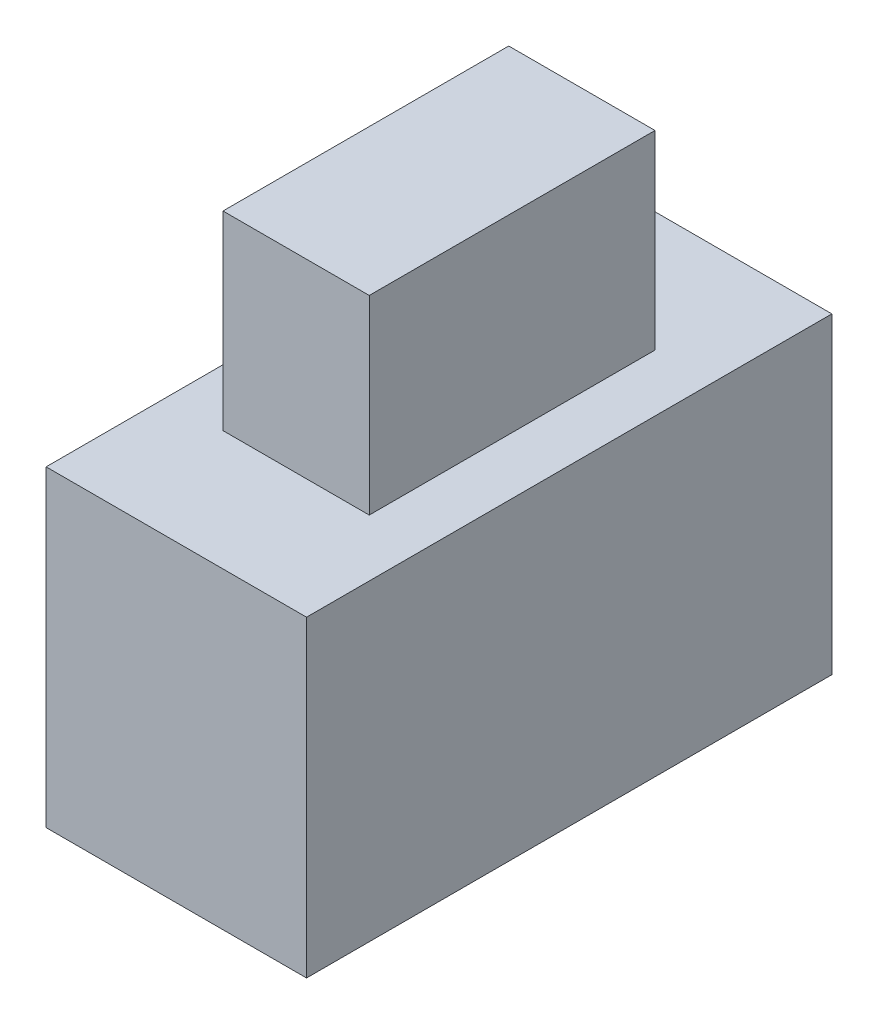
ISO-10303-21;
HEADER;
FILE_DESCRIPTION(('STEP AP214'),'2;1');
FILE_NAME('part.step','',(''),(''),'','','');
FILE_SCHEMA(('AUTOMOTIVE_DESIGN { 1 0 10303 214 1 1 1 1 }'));
ENDSEC;
DATA;
#1=APPLICATION_CONTEXT('core data for automotive mechanical design processes');
#2=APPLICATION_PROTOCOL_DEFINITION('international standard','automotive_design',2000,#1);
#3=PRODUCT_CONTEXT('',#1,'mechanical');
#4=PRODUCT('Part','Part','',(#3));
#5=PRODUCT_RELATED_PRODUCT_CATEGORY('part','',(#4));
#6=PRODUCT_DEFINITION_FORMATION('','',#4);
#7=PRODUCT_DEFINITION_CONTEXT('part definition',#1,'design');
#8=PRODUCT_DEFINITION('design','',#6,#7);
#9=PRODUCT_DEFINITION_SHAPE('','',#8);
#10=(LENGTH_UNIT() NAMED_UNIT(*) SI_UNIT(.MILLI.,.METRE.));
#11=(NAMED_UNIT(*) PLANE_ANGLE_UNIT() SI_UNIT($,.RADIAN.));
#12=(NAMED_UNIT(*) SI_UNIT($,.STERADIAN.) SOLID_ANGLE_UNIT());
#13=UNCERTAINTY_MEASURE_WITH_UNIT(LENGTH_MEASURE(1.E-05),#10,'distance_accuracy_value','');
#14=(GEOMETRIC_REPRESENTATION_CONTEXT(3) GLOBAL_UNCERTAINTY_ASSIGNED_CONTEXT((#13)) GLOBAL_UNIT_ASSIGNED_CONTEXT((#10,
#11,#12)) REPRESENTATION_CONTEXT('',''));
#15=CARTESIAN_POINT('',(0.,0.,0.));
#16=DIRECTION('',(0.,0.,1.));
#17=DIRECTION('',(1.,0.,0.));
#18=AXIS2_PLACEMENT_3D('',#15,#16,#17);
#19=CARTESIAN_POINT('',(0.,6.9,0.));
#20=DIRECTION('',(0.,-1.,0.));
#21=DIRECTION('',(0.,0.,-1.));
#22=AXIS2_PLACEMENT_3D('',#19,#20,#21);
#23=PLANE('',#22);
#24=DIRECTION('',(0.,0.,1.));
#25=VECTOR('',#24,1.);
#26=CARTESIAN_POINT('',(0.,6.9,0.));
#27=LINE('',#26,#25);
#28=CARTESIAN_POINT('',(0.,6.9,-11.6));
#29=VERTEX_POINT('',#28);
#30=CARTESIAN_POINT('',(0.,6.9,0.));
#31=VERTEX_POINT('',#30);
#32=EDGE_CURVE('E127',#29,#31,#27,.T.);
#33=ORIENTED_EDGE('',*,*,#32,.T.);
#34=DIRECTION('',(1.,0.,0.));
#35=VECTOR('',#34,1.);
#36=CARTESIAN_POINT('',(0.,6.9,0.));
#37=LINE('',#36,#35);
#38=CARTESIAN_POINT('',(5.75,6.9,0.));
#39=VERTEX_POINT('',#38);
#40=EDGE_CURVE('E130',#31,#39,#37,.T.);
#41=ORIENTED_EDGE('',*,*,#40,.T.);
#42=DIRECTION('',(0.,0.,-1.));
#43=VECTOR('',#42,1.);
#44=CARTESIAN_POINT('',(5.75,6.9,0.));
#45=LINE('',#44,#43);
#46=CARTESIAN_POINT('',(5.75,6.9,-11.6));
#47=VERTEX_POINT('',#46);
#48=EDGE_CURVE('E133',#39,#47,#45,.T.);
#49=ORIENTED_EDGE('',*,*,#48,.T.);
#50=DIRECTION('',(-1.,0.,0.));
#51=VECTOR('',#50,1.);
#52=CARTESIAN_POINT('',(0.,6.9,-11.6));
#53=LINE('',#52,#51);
#54=EDGE_CURVE('E135',#47,#29,#53,.T.);
#55=ORIENTED_EDGE('',*,*,#54,.T.);
#56=EDGE_LOOP('',(#33,#41,#49,#55));
#57=FACE_BOUND('',#56,.T.);
#58=DIRECTION('',(0.,0.,-1.));
#59=VECTOR('',#58,1.);
#60=CARTESIAN_POINT('',(4.49,6.9,-8.955));
#61=LINE('',#60,#59);
#62=CARTESIAN_POINT('',(4.49,6.9,-2.645));
#63=VERTEX_POINT('',#62);
#64=CARTESIAN_POINT('',(4.49,6.9,-8.955));
#65=VERTEX_POINT('',#64);
#66=EDGE_CURVE('E117',#63,#65,#61,.T.);
#67=ORIENTED_EDGE('',*,*,#66,.F.);
#68=DIRECTION('',(1.,0.,0.));
#69=VECTOR('',#68,1.);
#70=CARTESIAN_POINT('',(1.26,6.9,-2.645));
#71=LINE('',#70,#69);
#72=CARTESIAN_POINT('',(1.26,6.9,-2.645));
#73=VERTEX_POINT('',#72);
#74=EDGE_CURVE('E114',#73,#63,#71,.T.);
#75=ORIENTED_EDGE('',*,*,#74,.F.);
#76=DIRECTION('',(0.,0.,1.));
#77=VECTOR('',#76,1.);
#78=CARTESIAN_POINT('',(1.26,6.9,-8.955));
#79=LINE('',#78,#77);
#80=CARTESIAN_POINT('',(1.26,6.9,-8.955));
#81=VERTEX_POINT('',#80);
#82=EDGE_CURVE('E52',#81,#73,#79,.T.);
#83=ORIENTED_EDGE('',*,*,#82,.F.);
#84=DIRECTION('',(-1.,0.,0.));
#85=VECTOR('',#84,1.);
#86=CARTESIAN_POINT('',(1.26,6.9,-8.955));
#87=LINE('',#86,#85);
#88=EDGE_CURVE('E47',#65,#81,#87,.T.);
#89=ORIENTED_EDGE('',*,*,#88,.F.);
#90=EDGE_LOOP('',(#67,#75,#83,#89));
#91=FACE_BOUND('',#90,.T.);
#92=ADVANCED_FACE('F32',(#57,#91),#23,.F.);
#93=CARTESIAN_POINT('',(0.,6.9,0.));
#94=DIRECTION('',(1.,0.,0.));
#95=DIRECTION('',(0.,0.,-1.));
#96=AXIS2_PLACEMENT_3D('',#93,#94,#95);
#97=PLANE('',#96);
#98=DIRECTION('',(0.,0.,1.));
#99=VECTOR('',#98,1.);
#100=CARTESIAN_POINT('',(0.,0.,0.));
#101=LINE('',#100,#99);
#102=CARTESIAN_POINT('',(0.,0.,-11.6));
#103=VERTEX_POINT('',#102);
#104=CARTESIAN_POINT('',(0.,0.,0.));
#105=VERTEX_POINT('',#104);
#106=EDGE_CURVE('E118',#103,#105,#101,.T.);
#107=ORIENTED_EDGE('',*,*,#106,.T.);
#108=DIRECTION('',(0.,-1.,0.));
#109=VECTOR('',#108,1.);
#110=CARTESIAN_POINT('',(0.,6.9,0.));
#111=LINE('',#110,#109);
#112=EDGE_CURVE('E11',#31,#105,#111,.T.);
#113=ORIENTED_EDGE('',*,*,#112,.F.);
#114=ORIENTED_EDGE('',*,*,#32,.F.);
#115=DIRECTION('',(0.,-1.,0.));
#116=VECTOR('',#115,1.);
#117=CARTESIAN_POINT('',(0.,6.9,-11.6));
#118=LINE('',#117,#116);
#119=EDGE_CURVE('E136',#29,#103,#118,.T.);
#120=ORIENTED_EDGE('',*,*,#119,.T.);
#121=EDGE_LOOP('',(#107,#113,#114,#120));
#122=FACE_BOUND('',#121,.T.);
#123=ADVANCED_FACE('F34',(#122),#97,.F.);
#124=CARTESIAN_POINT('',(0.,6.9,0.));
#125=DIRECTION('',(0.,0.,-1.));
#126=DIRECTION('',(-1.,0.,0.));
#127=AXIS2_PLACEMENT_3D('',#124,#125,#126);
#128=PLANE('',#127);
#129=DIRECTION('',(1.,0.,0.));
#130=VECTOR('',#129,1.);
#131=CARTESIAN_POINT('',(0.,0.,0.));
#132=LINE('',#131,#130);
#133=CARTESIAN_POINT('',(5.75,0.,0.));
#134=VERTEX_POINT('',#133);
#135=EDGE_CURVE('E121',#105,#134,#132,.T.);
#136=ORIENTED_EDGE('',*,*,#135,.T.);
#137=DIRECTION('',(0.,-1.,0.));
#138=VECTOR('',#137,1.);
#139=CARTESIAN_POINT('',(5.75,6.9,0.));
#140=LINE('',#139,#138);
#141=EDGE_CURVE('E40',#39,#134,#140,.T.);
#142=ORIENTED_EDGE('',*,*,#141,.F.);
#143=ORIENTED_EDGE('',*,*,#40,.F.);
#144=ORIENTED_EDGE('',*,*,#112,.T.);
#145=EDGE_LOOP('',(#136,#142,#143,#144));
#146=FACE_BOUND('',#145,.T.);
#147=ADVANCED_FACE('F166',(#146),#128,.F.);
#148=CARTESIAN_POINT('',(5.75,6.9,0.));
#149=DIRECTION('',(-1.,0.,0.));
#150=DIRECTION('',(0.,0.,1.));
#151=AXIS2_PLACEMENT_3D('',#148,#149,#150);
#152=PLANE('',#151);
#153=DIRECTION('',(0.,0.,-1.));
#154=VECTOR('',#153,1.);
#155=CARTESIAN_POINT('',(5.75,0.,0.));
#156=LINE('',#155,#154);
#157=CARTESIAN_POINT('',(5.75,0.,-11.6));
#158=VERTEX_POINT('',#157);
#159=EDGE_CURVE('E139',#134,#158,#156,.T.);
#160=ORIENTED_EDGE('',*,*,#159,.T.);
#161=DIRECTION('',(0.,-1.,0.));
#162=VECTOR('',#161,1.);
#163=CARTESIAN_POINT('',(5.75,6.9,-11.6));
#164=LINE('',#163,#162);
#165=EDGE_CURVE('E144',#47,#158,#164,.T.);
#166=ORIENTED_EDGE('',*,*,#165,.F.);
#167=ORIENTED_EDGE('',*,*,#48,.F.);
#168=ORIENTED_EDGE('',*,*,#141,.T.);
#169=EDGE_LOOP('',(#160,#166,#167,#168));
#170=FACE_BOUND('',#169,.T.);
#171=ADVANCED_FACE('F151',(#170),#152,.F.);
#172=CARTESIAN_POINT('',(0.,6.9,-11.6));
#173=DIRECTION('',(0.,0.,1.));
#174=DIRECTION('',(1.,0.,0.));
#175=AXIS2_PLACEMENT_3D('',#172,#173,#174);
#176=PLANE('',#175);
#177=DIRECTION('',(-1.,0.,0.));
#178=VECTOR('',#177,1.);
#179=CARTESIAN_POINT('',(0.,0.,-11.6));
#180=LINE('',#179,#178);
#181=EDGE_CURVE('E131',#158,#103,#180,.T.);
#182=ORIENTED_EDGE('',*,*,#181,.T.);
#183=ORIENTED_EDGE('',*,*,#119,.F.);
#184=ORIENTED_EDGE('',*,*,#54,.F.);
#185=ORIENTED_EDGE('',*,*,#165,.T.);
#186=EDGE_LOOP('',(#182,#183,#184,#185));
#187=FACE_BOUND('',#186,.T.);
#188=ADVANCED_FACE('F160',(#187),#176,.F.);
#189=CARTESIAN_POINT('',(0.,0.,0.));
#190=DIRECTION('',(0.,-1.,0.));
#191=DIRECTION('',(0.,0.,-1.));
#192=AXIS2_PLACEMENT_3D('',#189,#190,#191);
#193=PLANE('',#192);
#194=ORIENTED_EDGE('',*,*,#106,.F.);
#195=ORIENTED_EDGE('',*,*,#181,.F.);
#196=ORIENTED_EDGE('',*,*,#159,.F.);
#197=ORIENTED_EDGE('',*,*,#135,.F.);
#198=EDGE_LOOP('',(#194,#195,#196,#197));
#199=FACE_BOUND('',#198,.T.);
#200=ADVANCED_FACE('F157',(#199),#193,.T.);
#201=CARTESIAN_POINT('',(4.49,11.1,-8.955));
#202=DIRECTION('',(-1.,0.,0.));
#203=DIRECTION('',(0.,0.,1.));
#204=AXIS2_PLACEMENT_3D('',#201,#202,#203);
#205=PLANE('',#204);
#206=ORIENTED_EDGE('',*,*,#66,.T.);
#207=DIRECTION('',(0.,-1.,0.));
#208=VECTOR('',#207,1.);
#209=CARTESIAN_POINT('',(4.49,11.1,-8.955));
#210=LINE('',#209,#208);
#211=CARTESIAN_POINT('',(4.49,11.1,-8.955));
#212=VERTEX_POINT('',#211);
#213=EDGE_CURVE('E98',#212,#65,#210,.T.);
#214=ORIENTED_EDGE('',*,*,#213,.F.);
#215=DIRECTION('',(0.,0.,-1.));
#216=VECTOR('',#215,1.);
#217=CARTESIAN_POINT('',(4.49,11.1,-8.955));
#218=LINE('',#217,#216);
#219=CARTESIAN_POINT('',(4.49,11.1,-2.645));
#220=VERTEX_POINT('',#219);
#221=EDGE_CURVE('E105',#220,#212,#218,.T.);
#222=ORIENTED_EDGE('',*,*,#221,.F.);
#223=DIRECTION('',(0.,-1.,0.));
#224=VECTOR('',#223,1.);
#225=CARTESIAN_POINT('',(4.49,11.1,-2.645));
#226=LINE('',#225,#224);
#227=EDGE_CURVE('E259',#220,#63,#226,.T.);
#228=ORIENTED_EDGE('',*,*,#227,.T.);
#229=EDGE_LOOP('',(#206,#214,#222,#228));
#230=FACE_BOUND('',#229,.T.);
#231=ADVANCED_FACE('F116',(#230),#205,.F.);
#232=CARTESIAN_POINT('',(1.26,11.1,-8.955));
#233=DIRECTION('',(0.,0.,1.));
#234=DIRECTION('',(1.,0.,0.));
#235=AXIS2_PLACEMENT_3D('',#232,#233,#234);
#236=PLANE('',#235);
#237=ORIENTED_EDGE('',*,*,#88,.T.);
#238=DIRECTION('',(0.,-1.,0.));
#239=VECTOR('',#238,1.);
#240=CARTESIAN_POINT('',(1.26,11.1,-8.955));
#241=LINE('',#240,#239);
#242=CARTESIAN_POINT('',(1.26,11.1,-8.955));
#243=VERTEX_POINT('',#242);
#244=EDGE_CURVE('E101',#243,#81,#241,.T.);
#245=ORIENTED_EDGE('',*,*,#244,.F.);
#246=DIRECTION('',(-1.,0.,0.));
#247=VECTOR('',#246,1.);
#248=CARTESIAN_POINT('',(1.26,11.1,-8.955));
#249=LINE('',#248,#247);
#250=EDGE_CURVE('E94',#212,#243,#249,.T.);
#251=ORIENTED_EDGE('',*,*,#250,.F.);
#252=ORIENTED_EDGE('',*,*,#213,.T.);
#253=EDGE_LOOP('',(#237,#245,#251,#252));
#254=FACE_BOUND('',#253,.T.);
#255=ADVANCED_FACE('F96',(#254),#236,.F.);
#256=CARTESIAN_POINT('',(1.26,11.1,-8.955));
#257=DIRECTION('',(1.,0.,0.));
#258=DIRECTION('',(0.,0.,-1.));
#259=AXIS2_PLACEMENT_3D('',#256,#257,#258);
#260=PLANE('',#259);
#261=ORIENTED_EDGE('',*,*,#82,.T.);
#262=DIRECTION('',(0.,-1.,0.));
#263=VECTOR('',#262,1.);
#264=CARTESIAN_POINT('',(1.26,11.1,-2.645));
#265=LINE('',#264,#263);
#266=CARTESIAN_POINT('',(1.26,11.1,-2.645));
#267=VERTEX_POINT('',#266);
#268=EDGE_CURVE('E123',#267,#73,#265,.T.);
#269=ORIENTED_EDGE('',*,*,#268,.F.);
#270=DIRECTION('',(0.,0.,1.));
#271=VECTOR('',#270,1.);
#272=CARTESIAN_POINT('',(1.26,11.1,-8.955));
#273=LINE('',#272,#271);
#274=EDGE_CURVE('E104',#243,#267,#273,.T.);
#275=ORIENTED_EDGE('',*,*,#274,.F.);
#276=ORIENTED_EDGE('',*,*,#244,.T.);
#277=EDGE_LOOP('',(#261,#269,#275,#276));
#278=FACE_BOUND('',#277,.T.);
#279=ADVANCED_FACE('F202',(#278),#260,.F.);
#280=CARTESIAN_POINT('',(1.26,11.1,-2.645));
#281=DIRECTION('',(0.,0.,-1.));
#282=DIRECTION('',(-1.,0.,0.));
#283=AXIS2_PLACEMENT_3D('',#280,#281,#282);
#284=PLANE('',#283);
#285=ORIENTED_EDGE('',*,*,#74,.T.);
#286=ORIENTED_EDGE('',*,*,#227,.F.);
#287=DIRECTION('',(1.,0.,0.));
#288=VECTOR('',#287,1.);
#289=CARTESIAN_POINT('',(1.26,11.1,-2.645));
#290=LINE('',#289,#288);
#291=EDGE_CURVE('E110',#267,#220,#290,.T.);
#292=ORIENTED_EDGE('',*,*,#291,.F.);
#293=ORIENTED_EDGE('',*,*,#268,.T.);
#294=EDGE_LOOP('',(#285,#286,#292,#293));
#295=FACE_BOUND('',#294,.T.);
#296=ADVANCED_FACE('F208',(#295),#284,.F.);
#297=CARTESIAN_POINT('',(0.,11.1,0.));
#298=DIRECTION('',(0.,1.,0.));
#299=DIRECTION('',(0.,0.,1.));
#300=AXIS2_PLACEMENT_3D('',#297,#298,#299);
#301=PLANE('',#300);
#302=ORIENTED_EDGE('',*,*,#221,.T.);
#303=ORIENTED_EDGE('',*,*,#250,.T.);
#304=ORIENTED_EDGE('',*,*,#274,.T.);
#305=ORIENTED_EDGE('',*,*,#291,.T.);
#306=EDGE_LOOP('',(#302,#303,#304,#305));
#307=FACE_BOUND('',#306,.T.);
#308=ADVANCED_FACE('F108',(#307),#301,.T.);
#309=CLOSED_SHELL('',(#92,#123,#147,#171,#188,#200,#231,#255,#279,#296,#308));
#310=MANIFOLD_SOLID_BREP('B2',#309);
#311=ADVANCED_BREP_SHAPE_REPRESENTATION('',(#18,#310),#14);
#312=SHAPE_DEFINITION_REPRESENTATION(#9,#311);
ENDSEC;
END-ISO-10303-21;
